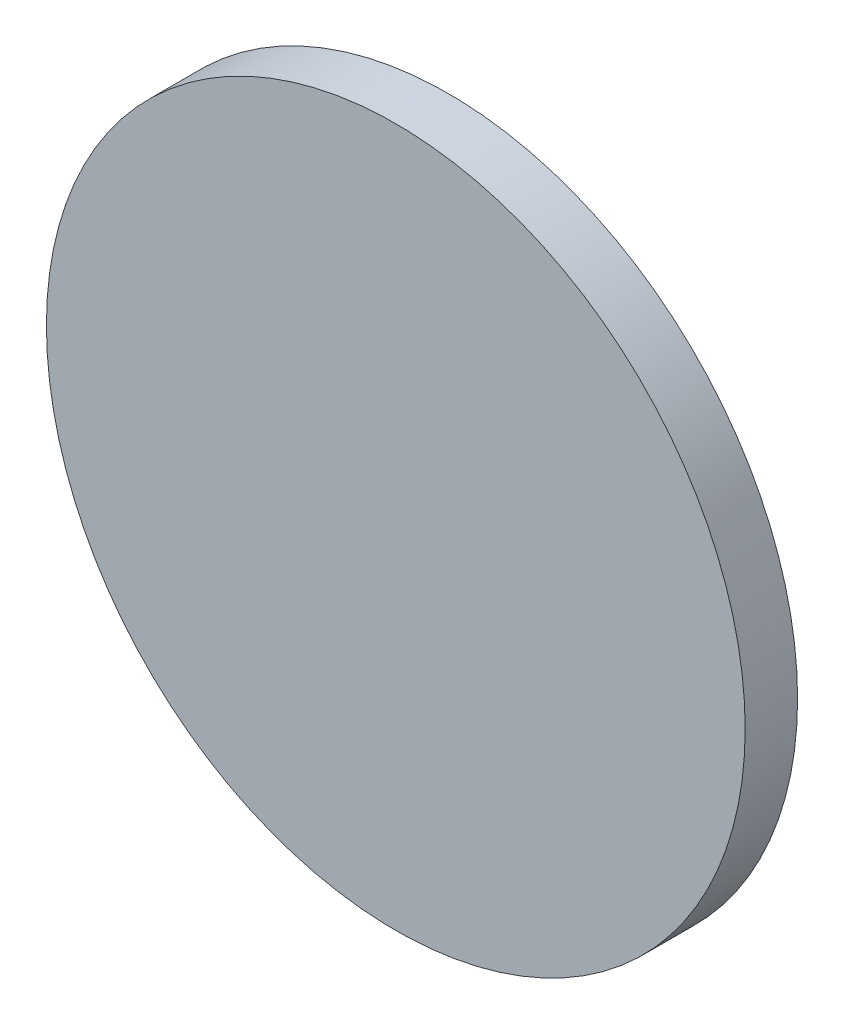
ISO-10303-21;
HEADER;
FILE_DESCRIPTION(('STEP AP214'),'2;1');
FILE_NAME('part.step','',(''),(''),'','','');
FILE_SCHEMA(('AUTOMOTIVE_DESIGN { 1 0 10303 214 1 1 1 1 }'));
ENDSEC;
DATA;
#1=APPLICATION_CONTEXT('core data for automotive mechanical design processes');
#2=APPLICATION_PROTOCOL_DEFINITION('international standard','automotive_design',2000,#1);
#3=PRODUCT_CONTEXT('',#1,'mechanical');
#4=PRODUCT('Part','Part','',(#3));
#5=PRODUCT_RELATED_PRODUCT_CATEGORY('part','',(#4));
#6=PRODUCT_DEFINITION_FORMATION('','',#4);
#7=PRODUCT_DEFINITION_CONTEXT('part definition',#1,'design');
#8=PRODUCT_DEFINITION('design','',#6,#7);
#9=PRODUCT_DEFINITION_SHAPE('','',#8);
#10=(LENGTH_UNIT() NAMED_UNIT(*) SI_UNIT(.MILLI.,.METRE.));
#11=(NAMED_UNIT(*) PLANE_ANGLE_UNIT() SI_UNIT($,.RADIAN.));
#12=(NAMED_UNIT(*) SI_UNIT($,.STERADIAN.) SOLID_ANGLE_UNIT());
#13=UNCERTAINTY_MEASURE_WITH_UNIT(LENGTH_MEASURE(1.E-05),#10,'distance_accuracy_value','');
#14=(GEOMETRIC_REPRESENTATION_CONTEXT(3) GLOBAL_UNCERTAINTY_ASSIGNED_CONTEXT((#13)) GLOBAL_UNIT_ASSIGNED_CONTEXT((#10,
#11,#12)) REPRESENTATION_CONTEXT('',''));
#15=CARTESIAN_POINT('',(0.,0.,0.));
#16=DIRECTION('',(0.,0.,1.));
#17=DIRECTION('',(1.,0.,0.));
#18=AXIS2_PLACEMENT_3D('',#15,#16,#17);
#19=CARTESIAN_POINT('',(10.44416,13.13491,0.79916));
#20=DIRECTION('',(0.,0.,1.));
#21=DIRECTION('',(1.,0.,0.));
#22=AXIS2_PLACEMENT_3D('',#19,#20,#21);
#23=PLANE('',#22);
#24=CARTESIAN_POINT('',(10.44416,13.13491,0.79916));
#25=DIRECTION('',(0.,0.,1.));
#26=DIRECTION('',(1.,0.,0.));
#27=AXIS2_PLACEMENT_3D('',#24,#25,#26);
#28=CIRCLE('',#27,0.2286);
#29=CARTESIAN_POINT('',(10.67276,13.13491,0.79916));
#30=VERTEX_POINT('',#29);
#31=EDGE_CURVE('E18',#30,#30,#28,.F.);
#32=ORIENTED_EDGE('',*,*,#31,.F.);
#33=EDGE_LOOP('',(#32));
#34=FACE_BOUND('',#33,.T.);
#35=ADVANCED_FACE('F15',(#34),#23,.T.);
#36=CARTESIAN_POINT('',(10.44416,13.13491,0.76487));
#37=DIRECTION('',(0.,0.,1.));
#38=DIRECTION('',(1.,0.,0.));
#39=AXIS2_PLACEMENT_3D('',#36,#37,#38);
#40=CYLINDRICAL_SURFACE('',#39,0.2286);
#41=ORIENTED_EDGE('',*,*,#31,.T.);
#42=EDGE_LOOP('',(#41));
#43=FACE_BOUND('',#42,.T.);
#44=CARTESIAN_POINT('',(10.44416,13.13491,0.76487));
#45=DIRECTION('',(0.,0.,1.));
#46=DIRECTION('',(1.,0.,0.));
#47=AXIS2_PLACEMENT_3D('',#44,#45,#46);
#48=CIRCLE('',#47,0.2286);
#49=CARTESIAN_POINT('',(10.67276,13.13491,0.76487));
#50=VERTEX_POINT('',#49);
#51=EDGE_CURVE('E10',#50,#50,#48,.F.);
#52=ORIENTED_EDGE('',*,*,#51,.F.);
#53=EDGE_LOOP('',(#52));
#54=FACE_BOUND('',#53,.T.);
#55=ADVANCED_FACE('F27',(#43,#54),#40,.T.);
#56=CARTESIAN_POINT('',(10.44416,13.13491,0.76487));
#57=DIRECTION('',(0.,0.,-1.));
#58=DIRECTION('',(-1.,0.,0.));
#59=AXIS2_PLACEMENT_3D('',#56,#57,#58);
#60=PLANE('',#59);
#61=ORIENTED_EDGE('',*,*,#51,.T.);
#62=EDGE_LOOP('',(#61));
#63=FACE_BOUND('',#62,.T.);
#64=ADVANCED_FACE('F35',(#63),#60,.T.);
#65=CLOSED_SHELL('',(#35,#55,#64));
#66=MANIFOLD_SOLID_BREP('B1',#65);
#67=ADVANCED_BREP_SHAPE_REPRESENTATION('',(#18,#66),#14);
#68=SHAPE_DEFINITION_REPRESENTATION(#9,#67);
ENDSEC;
END-ISO-10303-21;
